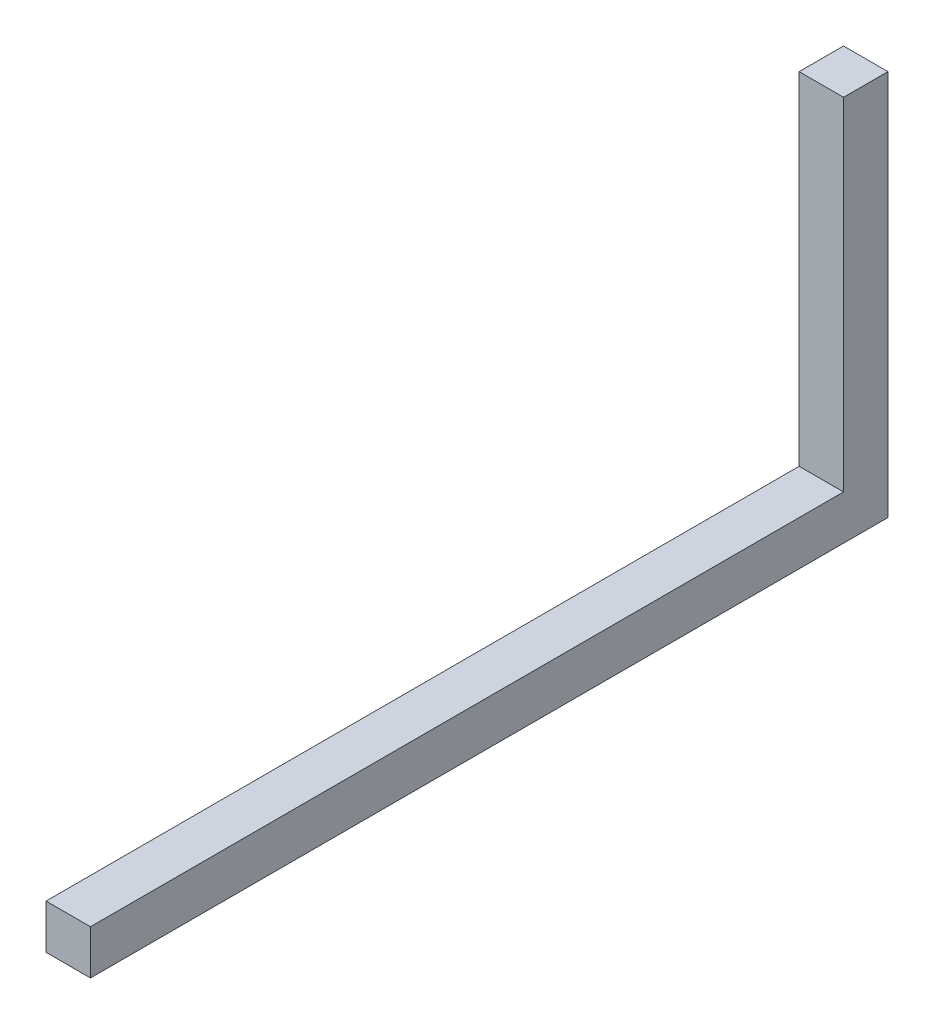
ISO-10303-21;
HEADER;
FILE_DESCRIPTION(('STEP AP214'),'2;1');
FILE_NAME('part.step','',(''),(''),'','','');
FILE_SCHEMA(('AUTOMOTIVE_DESIGN { 1 0 10303 214 1 1 1 1 }'));
ENDSEC;
DATA;
#1=APPLICATION_CONTEXT('core data for automotive mechanical design processes');
#2=APPLICATION_PROTOCOL_DEFINITION('international standard','automotive_design',2000,#1);
#3=PRODUCT_CONTEXT('',#1,'mechanical');
#4=PRODUCT('Part','Part','',(#3));
#5=PRODUCT_RELATED_PRODUCT_CATEGORY('part','',(#4));
#6=PRODUCT_DEFINITION_FORMATION('','',#4);
#7=PRODUCT_DEFINITION_CONTEXT('part definition',#1,'design');
#8=PRODUCT_DEFINITION('design','',#6,#7);
#9=PRODUCT_DEFINITION_SHAPE('','',#8);
#10=(LENGTH_UNIT() NAMED_UNIT(*) SI_UNIT(.MILLI.,.METRE.));
#11=(NAMED_UNIT(*) PLANE_ANGLE_UNIT() SI_UNIT($,.RADIAN.));
#12=(NAMED_UNIT(*) SI_UNIT($,.STERADIAN.) SOLID_ANGLE_UNIT());
#13=UNCERTAINTY_MEASURE_WITH_UNIT(LENGTH_MEASURE(1.E-05),#10,'distance_accuracy_value','');
#14=(GEOMETRIC_REPRESENTATION_CONTEXT(3) GLOBAL_UNCERTAINTY_ASSIGNED_CONTEXT((#13)) GLOBAL_UNIT_ASSIGNED_CONTEXT((#10,
#11,#12)) REPRESENTATION_CONTEXT('',''));
#15=CARTESIAN_POINT('',(0.,0.,0.));
#16=DIRECTION('',(0.,0.,1.));
#17=DIRECTION('',(1.,0.,0.));
#18=AXIS2_PLACEMENT_3D('',#15,#16,#17);
#19=CARTESIAN_POINT('',(-5.75000000000001,5.75,195.));
#20=DIRECTION('',(1.,0.,0.));
#21=DIRECTION('',(0.,0.,-1.));
#22=AXIS2_PLACEMENT_3D('',#19,#20,#21);
#23=PLANE('',#22);
#24=DIRECTION('',(0.,0.,-1.));
#25=VECTOR('',#24,1.);
#26=CARTESIAN_POINT('',(-5.75000000000001,5.75,195.));
#27=LINE('',#26,#25);
#28=CARTESIAN_POINT('',(-5.75000000000001,5.75,195.));
#29=VERTEX_POINT('',#28);
#30=CARTESIAN_POINT('',(-5.75000000000001,5.75,0.));
#31=VERTEX_POINT('',#30);
#32=EDGE_CURVE('E140',#29,#31,#27,.T.);
#33=ORIENTED_EDGE('',*,*,#32,.T.);
#34=DIRECTION('',(0.,-1.,0.));
#35=VECTOR('',#34,1.);
#36=CARTESIAN_POINT('',(-5.75,94.25,0.));
#37=LINE('',#36,#35);
#38=CARTESIAN_POINT('',(-5.75,94.25,0.));
#39=VERTEX_POINT('',#38);
#40=EDGE_CURVE('E127',#39,#31,#37,.T.);
#41=ORIENTED_EDGE('',*,*,#40,.F.);
#42=DIRECTION('',(0.,0.,1.));
#43=VECTOR('',#42,1.);
#44=CARTESIAN_POINT('',(-5.75,94.25,195.));
#45=LINE('',#44,#43);
#46=CARTESIAN_POINT('',(-5.75,94.25,-11.5));
#47=VERTEX_POINT('',#46);
#48=EDGE_CURVE('E102',#47,#39,#45,.T.);
#49=ORIENTED_EDGE('',*,*,#48,.F.);
#50=DIRECTION('',(0.,-1.,0.));
#51=VECTOR('',#50,1.);
#52=CARTESIAN_POINT('',(-5.75,94.25,-11.5));
#53=LINE('',#52,#51);
#54=CARTESIAN_POINT('',(-5.75,-5.75,-11.5));
#55=VERTEX_POINT('',#54);
#56=EDGE_CURVE('E98',#47,#55,#53,.T.);
#57=ORIENTED_EDGE('',*,*,#56,.T.);
#58=DIRECTION('',(0.,0.,-1.));
#59=VECTOR('',#58,1.);
#60=CARTESIAN_POINT('',(-5.75000000000001,-5.75,195.));
#61=LINE('',#60,#59);
#62=CARTESIAN_POINT('',(-5.75000000000001,-5.75,195.));
#63=VERTEX_POINT('',#62);
#64=EDGE_CURVE('E11',#63,#55,#61,.T.);
#65=ORIENTED_EDGE('',*,*,#64,.F.);
#66=DIRECTION('',(0.,-1.,0.));
#67=VECTOR('',#66,1.);
#68=CARTESIAN_POINT('',(-5.75000000000001,5.75,195.));
#69=LINE('',#68,#67);
#70=EDGE_CURVE('E125',#29,#63,#69,.T.);
#71=ORIENTED_EDGE('',*,*,#70,.F.);
#72=EDGE_LOOP('',(#33,#41,#49,#57,#65,#71));
#73=FACE_BOUND('',#72,.T.);
#74=ADVANCED_FACE('F43',(#73),#23,.F.);
#75=CARTESIAN_POINT('',(5.75,-5.75,195.));
#76=DIRECTION('',(0.,1.,0.));
#77=DIRECTION('',(-1.,0.,0.));
#78=AXIS2_PLACEMENT_3D('',#75,#76,#77);
#79=PLANE('',#78);
#80=ORIENTED_EDGE('',*,*,#64,.T.);
#81=DIRECTION('',(-1.,0.,0.));
#82=VECTOR('',#81,1.);
#83=CARTESIAN_POINT('',(5.75,-5.75,-11.5));
#84=LINE('',#83,#82);
#85=CARTESIAN_POINT('',(5.75,-5.75,-11.5));
#86=VERTEX_POINT('',#85);
#87=EDGE_CURVE('E113',#86,#55,#84,.T.);
#88=ORIENTED_EDGE('',*,*,#87,.F.);
#89=DIRECTION('',(0.,0.,-1.));
#90=VECTOR('',#89,1.);
#91=CARTESIAN_POINT('',(5.75,-5.75,195.));
#92=LINE('',#91,#90);
#93=CARTESIAN_POINT('',(5.75,-5.75,195.));
#94=VERTEX_POINT('',#93);
#95=EDGE_CURVE('E52',#94,#86,#92,.T.);
#96=ORIENTED_EDGE('',*,*,#95,.F.);
#97=DIRECTION('',(1.,0.,0.));
#98=VECTOR('',#97,1.);
#99=CARTESIAN_POINT('',(5.75,-5.75,195.));
#100=LINE('',#99,#98);
#101=EDGE_CURVE('E133',#63,#94,#100,.T.);
#102=ORIENTED_EDGE('',*,*,#101,.F.);
#103=EDGE_LOOP('',(#80,#88,#96,#102));
#104=FACE_BOUND('',#103,.T.);
#105=ADVANCED_FACE('F178',(#104),#79,.F.);
#106=CARTESIAN_POINT('',(5.75,5.75,195.));
#107=DIRECTION('',(-1.,0.,0.));
#108=DIRECTION('',(0.,0.,1.));
#109=AXIS2_PLACEMENT_3D('',#106,#107,#108);
#110=PLANE('',#109);
#111=ORIENTED_EDGE('',*,*,#95,.T.);
#112=DIRECTION('',(0.,-1.,0.));
#113=VECTOR('',#112,1.);
#114=CARTESIAN_POINT('',(5.75,94.25,-11.5));
#115=LINE('',#114,#113);
#116=CARTESIAN_POINT('',(5.75,94.25,-11.5));
#117=VERTEX_POINT('',#116);
#118=EDGE_CURVE('E96',#117,#86,#115,.T.);
#119=ORIENTED_EDGE('',*,*,#118,.F.);
#120=DIRECTION('',(0.,0.,-1.));
#121=VECTOR('',#120,1.);
#122=CARTESIAN_POINT('',(5.75,94.25,195.));
#123=LINE('',#122,#121);
#124=CARTESIAN_POINT('',(5.75,94.25,0.));
#125=VERTEX_POINT('',#124);
#126=EDGE_CURVE('E103',#125,#117,#123,.T.);
#127=ORIENTED_EDGE('',*,*,#126,.F.);
#128=DIRECTION('',(0.,-1.,0.));
#129=VECTOR('',#128,1.);
#130=CARTESIAN_POINT('',(5.75,94.25,0.));
#131=LINE('',#130,#129);
#132=CARTESIAN_POINT('',(5.75,5.74999999999999,0.));
#133=VERTEX_POINT('',#132);
#134=EDGE_CURVE('E152',#125,#133,#131,.T.);
#135=ORIENTED_EDGE('',*,*,#134,.T.);
#136=DIRECTION('',(0.,0.,-1.));
#137=VECTOR('',#136,1.);
#138=CARTESIAN_POINT('',(5.75,5.75,195.));
#139=LINE('',#138,#137);
#140=CARTESIAN_POINT('',(5.75,5.75,195.));
#141=VERTEX_POINT('',#140);
#142=EDGE_CURVE('E145',#141,#133,#139,.T.);
#143=ORIENTED_EDGE('',*,*,#142,.F.);
#144=DIRECTION('',(0.,1.,0.));
#145=VECTOR('',#144,1.);
#146=CARTESIAN_POINT('',(5.75,5.75,195.));
#147=LINE('',#146,#145);
#148=EDGE_CURVE('E136',#94,#141,#147,.T.);
#149=ORIENTED_EDGE('',*,*,#148,.F.);
#150=EDGE_LOOP('',(#111,#119,#127,#135,#143,#149));
#151=FACE_BOUND('',#150,.T.);
#152=ADVANCED_FACE('F115',(#151),#110,.F.);
#153=CARTESIAN_POINT('',(5.75,5.75,195.));
#154=DIRECTION('',(0.,-1.,0.));
#155=DIRECTION('',(1.,0.,0.));
#156=AXIS2_PLACEMENT_3D('',#153,#154,#155);
#157=PLANE('',#156);
#158=DIRECTION('',(-1.,0.,0.));
#159=VECTOR('',#158,1.);
#160=CARTESIAN_POINT('',(5.75,5.75,0.));
#161=LINE('',#160,#159);
#162=EDGE_CURVE('E120',#133,#31,#161,.T.);
#163=ORIENTED_EDGE('',*,*,#162,.T.);
#164=ORIENTED_EDGE('',*,*,#32,.F.);
#165=DIRECTION('',(-1.,0.,0.));
#166=VECTOR('',#165,1.);
#167=CARTESIAN_POINT('',(5.75,5.75,195.));
#168=LINE('',#167,#166);
#169=EDGE_CURVE('E59',#141,#29,#168,.T.);
#170=ORIENTED_EDGE('',*,*,#169,.F.);
#171=ORIENTED_EDGE('',*,*,#142,.T.);
#172=EDGE_LOOP('',(#163,#164,#170,#171));
#173=FACE_BOUND('',#172,.T.);
#174=ADVANCED_FACE('F151',(#173),#157,.F.);
#175=CARTESIAN_POINT('',(0.,0.,195.));
#176=DIRECTION('',(0.,0.,-1.));
#177=DIRECTION('',(-1.,0.,0.));
#178=AXIS2_PLACEMENT_3D('',#175,#176,#177);
#179=PLANE('',#178);
#180=ORIENTED_EDGE('',*,*,#70,.T.);
#181=ORIENTED_EDGE('',*,*,#101,.T.);
#182=ORIENTED_EDGE('',*,*,#148,.T.);
#183=ORIENTED_EDGE('',*,*,#169,.T.);
#184=EDGE_LOOP('',(#180,#181,#182,#183));
#185=FACE_BOUND('',#184,.T.);
#186=ADVANCED_FACE('F175',(#185),#179,.F.);
#187=CARTESIAN_POINT('',(5.75,94.25,-11.5));
#188=DIRECTION('',(0.,0.,1.));
#189=DIRECTION('',(1.,0.,0.));
#190=AXIS2_PLACEMENT_3D('',#187,#188,#189);
#191=PLANE('',#190);
#192=ORIENTED_EDGE('',*,*,#87,.T.);
#193=ORIENTED_EDGE('',*,*,#56,.F.);
#194=DIRECTION('',(-1.,0.,0.));
#195=VECTOR('',#194,1.);
#196=CARTESIAN_POINT('',(5.75,94.25,-11.5));
#197=LINE('',#196,#195);
#198=EDGE_CURVE('E91',#117,#47,#197,.T.);
#199=ORIENTED_EDGE('',*,*,#198,.F.);
#200=ORIENTED_EDGE('',*,*,#118,.T.);
#201=EDGE_LOOP('',(#192,#193,#199,#200));
#202=FACE_BOUND('',#201,.T.);
#203=ADVANCED_FACE('F94',(#202),#191,.F.);
#204=CARTESIAN_POINT('',(5.74999999999997,94.25,0.));
#205=DIRECTION('',(0.,0.,-1.));
#206=DIRECTION('',(-1.,0.,0.));
#207=AXIS2_PLACEMENT_3D('',#204,#205,#206);
#208=PLANE('',#207);
#209=ORIENTED_EDGE('',*,*,#162,.F.);
#210=ORIENTED_EDGE('',*,*,#134,.F.);
#211=DIRECTION('',(1.,0.,0.));
#212=VECTOR('',#211,1.);
#213=CARTESIAN_POINT('',(5.74999999999997,94.25,0.));
#214=LINE('',#213,#212);
#215=EDGE_CURVE('E108',#39,#125,#214,.T.);
#216=ORIENTED_EDGE('',*,*,#215,.F.);
#217=ORIENTED_EDGE('',*,*,#40,.T.);
#218=EDGE_LOOP('',(#209,#210,#216,#217));
#219=FACE_BOUND('',#218,.T.);
#220=ADVANCED_FACE('F167',(#219),#208,.F.);
#221=CARTESIAN_POINT('',(0.,94.25,0.));
#222=DIRECTION('',(0.,1.,0.));
#223=DIRECTION('',(-1.,0.,0.));
#224=AXIS2_PLACEMENT_3D('',#221,#222,#223);
#225=PLANE('',#224);
#226=ORIENTED_EDGE('',*,*,#126,.T.);
#227=ORIENTED_EDGE('',*,*,#198,.T.);
#228=ORIENTED_EDGE('',*,*,#48,.T.);
#229=ORIENTED_EDGE('',*,*,#215,.T.);
#230=EDGE_LOOP('',(#226,#227,#228,#229));
#231=FACE_BOUND('',#230,.T.);
#232=ADVANCED_FACE('F106',(#231),#225,.T.);
#233=CLOSED_SHELL('',(#74,#105,#152,#174,#186,#203,#220,#232));
#234=MANIFOLD_SOLID_BREP('B2',#233);
#235=ADVANCED_BREP_SHAPE_REPRESENTATION('',(#18,#234),#14);
#236=SHAPE_DEFINITION_REPRESENTATION(#9,#235);
ENDSEC;
END-ISO-10303-21;
